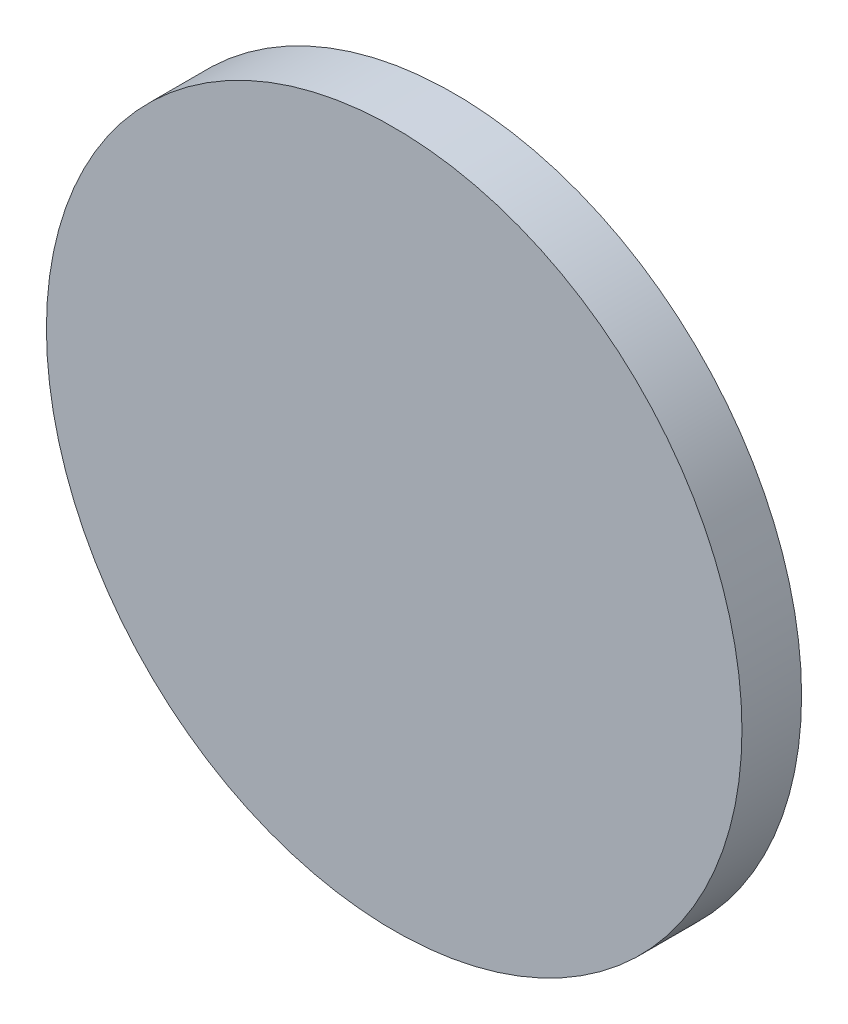
ISO-10303-21;
HEADER;
FILE_DESCRIPTION(('STEP AP214'),'2;1');
FILE_NAME('part.step','',(''),(''),'','','');
FILE_SCHEMA(('AUTOMOTIVE_DESIGN { 1 0 10303 214 1 1 1 1 }'));
ENDSEC;
DATA;
#1=APPLICATION_CONTEXT('core data for automotive mechanical design processes');
#2=APPLICATION_PROTOCOL_DEFINITION('international standard','automotive_design',2000,#1);
#3=PRODUCT_CONTEXT('',#1,'mechanical');
#4=PRODUCT('Part','Part','',(#3));
#5=PRODUCT_RELATED_PRODUCT_CATEGORY('part','',(#4));
#6=PRODUCT_DEFINITION_FORMATION('','',#4);
#7=PRODUCT_DEFINITION_CONTEXT('part definition',#1,'design');
#8=PRODUCT_DEFINITION('design','',#6,#7);
#9=PRODUCT_DEFINITION_SHAPE('','',#8);
#10=(LENGTH_UNIT() NAMED_UNIT(*) SI_UNIT(.MILLI.,.METRE.));
#11=(NAMED_UNIT(*) PLANE_ANGLE_UNIT() SI_UNIT($,.RADIAN.));
#12=(NAMED_UNIT(*) SI_UNIT($,.STERADIAN.) SOLID_ANGLE_UNIT());
#13=UNCERTAINTY_MEASURE_WITH_UNIT(LENGTH_MEASURE(1.E-05),#10,'distance_accuracy_value','');
#14=(GEOMETRIC_REPRESENTATION_CONTEXT(3) GLOBAL_UNCERTAINTY_ASSIGNED_CONTEXT((#13)) GLOBAL_UNIT_ASSIGNED_CONTEXT((#10,
#11,#12)) REPRESENTATION_CONTEXT('',''));
#15=CARTESIAN_POINT('',(0.,0.,0.));
#16=DIRECTION('',(0.,0.,1.));
#17=DIRECTION('',(1.,0.,0.));
#18=AXIS2_PLACEMENT_3D('',#15,#16,#17);
#19=CARTESIAN_POINT('',(2.6797,7.599680006176,0.76487));
#20=DIRECTION('',(0.,0.,-1.));
#21=DIRECTION('',(-1.,0.,0.));
#22=AXIS2_PLACEMENT_3D('',#19,#20,#21);
#23=PLANE('',#22);
#24=CARTESIAN_POINT('',(2.6797,7.599680006176,0.76487));
#25=DIRECTION('',(0.,0.,1.));
#26=DIRECTION('',(1.,0.,0.));
#27=AXIS2_PLACEMENT_3D('',#24,#25,#26);
#28=CIRCLE('',#27,0.200024667);
#29=CARTESIAN_POINT('',(2.879724667,7.599680006176,0.76487));
#30=VERTEX_POINT('',#29);
#31=EDGE_CURVE('E18',#30,#30,#28,.T.);
#32=ORIENTED_EDGE('',*,*,#31,.F.);
#33=EDGE_LOOP('',(#32));
#34=FACE_BOUND('',#33,.T.);
#35=ADVANCED_FACE('F15',(#34),#23,.T.);
#36=CARTESIAN_POINT('',(2.6797,7.599680006176,0.76487));
#37=DIRECTION('',(0.,0.,1.));
#38=DIRECTION('',(1.,0.,0.));
#39=AXIS2_PLACEMENT_3D('',#36,#37,#38);
#40=CYLINDRICAL_SURFACE('',#39,0.200024667);
#41=CARTESIAN_POINT('',(2.6797,7.599680006176,0.79916));
#42=DIRECTION('',(0.,0.,1.));
#43=DIRECTION('',(1.,0.,0.));
#44=AXIS2_PLACEMENT_3D('',#41,#42,#43);
#45=CIRCLE('',#44,0.200024667);
#46=CARTESIAN_POINT('',(2.879724667,7.599680006176,0.79916));
#47=VERTEX_POINT('',#46);
#48=EDGE_CURVE('E10',#47,#47,#45,.T.);
#49=ORIENTED_EDGE('',*,*,#48,.F.);
#50=EDGE_LOOP('',(#49));
#51=FACE_BOUND('',#50,.T.);
#52=ORIENTED_EDGE('',*,*,#31,.T.);
#53=EDGE_LOOP('',(#52));
#54=FACE_BOUND('',#53,.T.);
#55=ADVANCED_FACE('F27',(#51,#54),#40,.T.);
#56=CARTESIAN_POINT('',(2.6797,7.599680006176,0.79916));
#57=DIRECTION('',(0.,0.,1.));
#58=DIRECTION('',(1.,0.,0.));
#59=AXIS2_PLACEMENT_3D('',#56,#57,#58);
#60=PLANE('',#59);
#61=ORIENTED_EDGE('',*,*,#48,.T.);
#62=EDGE_LOOP('',(#61));
#63=FACE_BOUND('',#62,.T.);
#64=ADVANCED_FACE('F34',(#63),#60,.T.);
#65=CLOSED_SHELL('',(#35,#55,#64));
#66=MANIFOLD_SOLID_BREP('B1',#65);
#67=ADVANCED_BREP_SHAPE_REPRESENTATION('',(#18,#66),#14);
#68=SHAPE_DEFINITION_REPRESENTATION(#9,#67);
ENDSEC;
END-ISO-10303-21;
